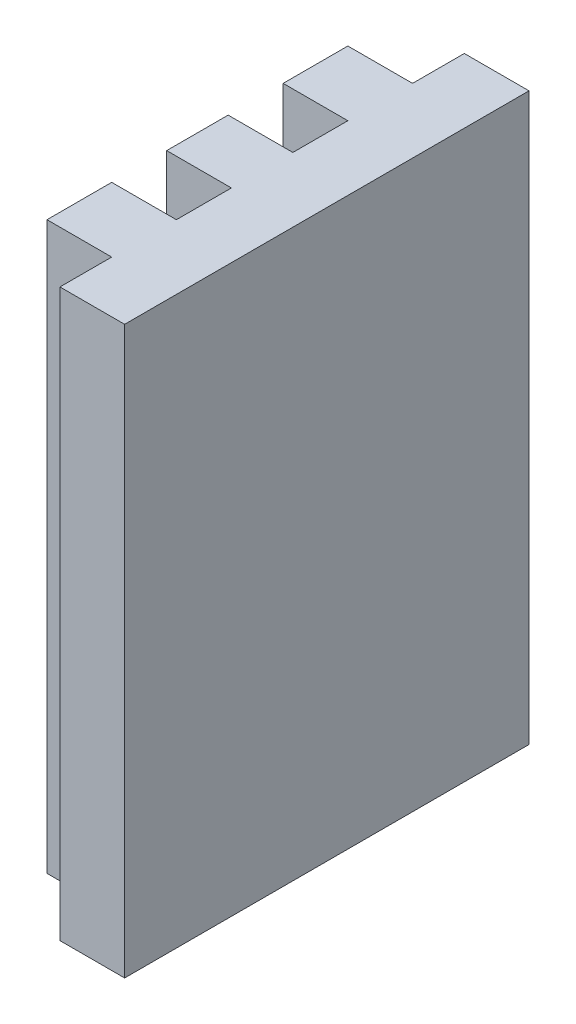
ISO-10303-21;
HEADER;
FILE_DESCRIPTION(('STEP AP214'),'2;1');
FILE_NAME('part.step','',(''),(''),'','','');
FILE_SCHEMA(('AUTOMOTIVE_DESIGN { 1 0 10303 214 1 1 1 1 }'));
ENDSEC;
DATA;
#1=APPLICATION_CONTEXT('core data for automotive mechanical design processes');
#2=APPLICATION_PROTOCOL_DEFINITION('international standard','automotive_design',2000,#1);
#3=PRODUCT_CONTEXT('',#1,'mechanical');
#4=PRODUCT('Part','Part','',(#3));
#5=PRODUCT_RELATED_PRODUCT_CATEGORY('part','',(#4));
#6=PRODUCT_DEFINITION_FORMATION('','',#4);
#7=PRODUCT_DEFINITION_CONTEXT('part definition',#1,'design');
#8=PRODUCT_DEFINITION('design','',#6,#7);
#9=PRODUCT_DEFINITION_SHAPE('','',#8);
#10=(LENGTH_UNIT() NAMED_UNIT(*) SI_UNIT(.MILLI.,.METRE.));
#11=(NAMED_UNIT(*) PLANE_ANGLE_UNIT() SI_UNIT($,.RADIAN.));
#12=(NAMED_UNIT(*) SI_UNIT($,.STERADIAN.) SOLID_ANGLE_UNIT());
#13=UNCERTAINTY_MEASURE_WITH_UNIT(LENGTH_MEASURE(1.E-05),#10,'distance_accuracy_value','');
#14=(GEOMETRIC_REPRESENTATION_CONTEXT(3) GLOBAL_UNCERTAINTY_ASSIGNED_CONTEXT((#13)) GLOBAL_UNIT_ASSIGNED_CONTEXT((#10,
#11,#12)) REPRESENTATION_CONTEXT('',''));
#15=CARTESIAN_POINT('',(0.,0.,0.));
#16=DIRECTION('',(0.,0.,1.));
#17=DIRECTION('',(1.,0.,0.));
#18=AXIS2_PLACEMENT_3D('',#15,#16,#17);
#19=CARTESIAN_POINT('',(7.,11.,-4.65));
#20=DIRECTION('',(1.,0.,0.));
#21=DIRECTION('',(0.,0.,-1.));
#22=AXIS2_PLACEMENT_3D('',#19,#20,#21);
#23=PLANE('',#22);
#24=DIRECTION('',(0.,0.,1.));
#25=VECTOR('',#24,1.);
#26=CARTESIAN_POINT('',(7.,-6.5,-4.65));
#27=LINE('',#26,#25);
#28=CARTESIAN_POINT('',(7.,-6.5,-4.65));
#29=VERTEX_POINT('',#28);
#30=CARTESIAN_POINT('',(7.,-6.5,-2.65));
#31=VERTEX_POINT('',#30);
#32=EDGE_CURVE('E21',#29,#31,#27,.T.);
#33=ORIENTED_EDGE('',*,*,#32,.T.);
#34=DIRECTION('',(0.,-1.,0.));
#35=VECTOR('',#34,1.);
#36=CARTESIAN_POINT('',(7.,11.,-2.65));
#37=LINE('',#36,#35);
#38=CARTESIAN_POINT('',(7.,11.,-2.65));
#39=VERTEX_POINT('',#38);
#40=EDGE_CURVE('E144',#39,#31,#37,.T.);
#41=ORIENTED_EDGE('',*,*,#40,.F.);
#42=DIRECTION('',(0.,0.,1.));
#43=VECTOR('',#42,1.);
#44=CARTESIAN_POINT('',(7.,11.,-4.65));
#45=LINE('',#44,#43);
#46=CARTESIAN_POINT('',(7.,11.,-4.65));
#47=VERTEX_POINT('',#46);
#48=EDGE_CURVE('E149',#47,#39,#45,.T.);
#49=ORIENTED_EDGE('',*,*,#48,.F.);
#50=DIRECTION('',(0.,-1.,0.));
#51=VECTOR('',#50,1.);
#52=CARTESIAN_POINT('',(7.,11.,-4.65));
#53=LINE('',#52,#51);
#54=EDGE_CURVE('E141',#47,#29,#53,.T.);
#55=ORIENTED_EDGE('',*,*,#54,.T.);
#56=EDGE_LOOP('',(#33,#41,#49,#55));
#57=FACE_BOUND('',#56,.T.);
#58=ADVANCED_FACE('F17',(#57),#23,.F.);
#59=CARTESIAN_POINT('',(7.,11.,-2.65));
#60=DIRECTION('',(0.,0.,-1.));
#61=DIRECTION('',(-1.,0.,0.));
#62=AXIS2_PLACEMENT_3D('',#59,#60,#61);
#63=PLANE('',#62);
#64=DIRECTION('',(1.,0.,0.));
#65=VECTOR('',#64,1.);
#66=CARTESIAN_POINT('',(7.,-6.5,-2.65));
#67=LINE('',#66,#65);
#68=CARTESIAN_POINT('',(9.,-6.5,-2.65));
#69=VERTEX_POINT('',#68);
#70=EDGE_CURVE('E133',#31,#69,#67,.T.);
#71=ORIENTED_EDGE('',*,*,#70,.T.);
#72=DIRECTION('',(0.,-1.,0.));
#73=VECTOR('',#72,1.);
#74=CARTESIAN_POINT('',(9.,11.,-2.65));
#75=LINE('',#74,#73);
#76=CARTESIAN_POINT('',(9.,11.,-2.65));
#77=VERTEX_POINT('',#76);
#78=EDGE_CURVE('E140',#77,#69,#75,.T.);
#79=ORIENTED_EDGE('',*,*,#78,.F.);
#80=DIRECTION('',(1.,0.,0.));
#81=VECTOR('',#80,1.);
#82=CARTESIAN_POINT('',(7.,11.,-2.65));
#83=LINE('',#82,#81);
#84=EDGE_CURVE('E127',#39,#77,#83,.T.);
#85=ORIENTED_EDGE('',*,*,#84,.F.);
#86=ORIENTED_EDGE('',*,*,#40,.T.);
#87=EDGE_LOOP('',(#71,#79,#85,#86));
#88=FACE_BOUND('',#87,.T.);
#89=ADVANCED_FACE('F145',(#88),#63,.F.);
#90=CARTESIAN_POINT('',(9.,11.,-2.65));
#91=DIRECTION('',(1.,0.,0.));
#92=DIRECTION('',(0.,0.,-1.));
#93=AXIS2_PLACEMENT_3D('',#90,#91,#92);
#94=PLANE('',#93);
#95=DIRECTION('',(0.,0.,1.));
#96=VECTOR('',#95,1.);
#97=CARTESIAN_POINT('',(9.,-6.5,-2.65));
#98=LINE('',#97,#96);
#99=CARTESIAN_POINT('',(9.,-6.5,-0.95));
#100=VERTEX_POINT('',#99);
#101=EDGE_CURVE('E137',#69,#100,#98,.T.);
#102=ORIENTED_EDGE('',*,*,#101,.T.);
#103=DIRECTION('',(0.,-1.,0.));
#104=VECTOR('',#103,1.);
#105=CARTESIAN_POINT('',(9.,11.,-0.95));
#106=LINE('',#105,#104);
#107=CARTESIAN_POINT('',(9.,11.,-0.95));
#108=VERTEX_POINT('',#107);
#109=EDGE_CURVE('E198',#108,#100,#106,.T.);
#110=ORIENTED_EDGE('',*,*,#109,.F.);
#111=DIRECTION('',(0.,0.,1.));
#112=VECTOR('',#111,1.);
#113=CARTESIAN_POINT('',(9.,11.,-2.65));
#114=LINE('',#113,#112);
#115=EDGE_CURVE('E203',#77,#108,#114,.T.);
#116=ORIENTED_EDGE('',*,*,#115,.F.);
#117=ORIENTED_EDGE('',*,*,#78,.T.);
#118=EDGE_LOOP('',(#102,#110,#116,#117));
#119=FACE_BOUND('',#118,.T.);
#120=ADVANCED_FACE('F171',(#119),#94,.F.);
#121=CARTESIAN_POINT('',(9.,11.,-0.95));
#122=DIRECTION('',(0.,0.,1.));
#123=DIRECTION('',(1.,0.,0.));
#124=AXIS2_PLACEMENT_3D('',#121,#122,#123);
#125=PLANE('',#124);
#126=DIRECTION('',(-1.,0.,0.));
#127=VECTOR('',#126,1.);
#128=CARTESIAN_POINT('',(9.,-6.5,-0.95));
#129=LINE('',#128,#127);
#130=CARTESIAN_POINT('',(7.,-6.5,-0.95));
#131=VERTEX_POINT('',#130);
#132=EDGE_CURVE('E207',#100,#131,#129,.T.);
#133=ORIENTED_EDGE('',*,*,#132,.T.);
#134=DIRECTION('',(0.,-1.,0.));
#135=VECTOR('',#134,1.);
#136=CARTESIAN_POINT('',(7.,11.,-0.95));
#137=LINE('',#136,#135);
#138=CARTESIAN_POINT('',(7.,11.,-0.95));
#139=VERTEX_POINT('',#138);
#140=EDGE_CURVE('E221',#139,#131,#137,.T.);
#141=ORIENTED_EDGE('',*,*,#140,.F.);
#142=DIRECTION('',(-1.,0.,0.));
#143=VECTOR('',#142,1.);
#144=CARTESIAN_POINT('',(9.,11.,-0.95));
#145=LINE('',#144,#143);
#146=EDGE_CURVE('E226',#108,#139,#145,.T.);
#147=ORIENTED_EDGE('',*,*,#146,.F.);
#148=ORIENTED_EDGE('',*,*,#109,.T.);
#149=EDGE_LOOP('',(#133,#141,#147,#148));
#150=FACE_BOUND('',#149,.T.);
#151=ADVANCED_FACE('F189',(#150),#125,.F.);
#152=CARTESIAN_POINT('',(7.,11.,-0.95));
#153=DIRECTION('',(1.,0.,0.));
#154=DIRECTION('',(0.,0.,-1.));
#155=AXIS2_PLACEMENT_3D('',#152,#153,#154);
#156=PLANE('',#155);
#157=DIRECTION('',(0.,0.,1.));
#158=VECTOR('',#157,1.);
#159=CARTESIAN_POINT('',(7.,-6.5,-0.95));
#160=LINE('',#159,#158);
#161=CARTESIAN_POINT('',(7.,-6.5,0.95));
#162=VERTEX_POINT('',#161);
#163=EDGE_CURVE('E230',#131,#162,#160,.T.);
#164=ORIENTED_EDGE('',*,*,#163,.T.);
#165=DIRECTION('',(0.,-1.,0.));
#166=VECTOR('',#165,1.);
#167=CARTESIAN_POINT('',(7.,11.,0.95));
#168=LINE('',#167,#166);
#169=CARTESIAN_POINT('',(7.,11.,0.95));
#170=VERTEX_POINT('',#169);
#171=EDGE_CURVE('E244',#170,#162,#168,.T.);
#172=ORIENTED_EDGE('',*,*,#171,.F.);
#173=DIRECTION('',(0.,0.,1.));
#174=VECTOR('',#173,1.);
#175=CARTESIAN_POINT('',(7.,11.,-0.95));
#176=LINE('',#175,#174);
#177=EDGE_CURVE('E249',#139,#170,#176,.T.);
#178=ORIENTED_EDGE('',*,*,#177,.F.);
#179=ORIENTED_EDGE('',*,*,#140,.T.);
#180=EDGE_LOOP('',(#164,#172,#178,#179));
#181=FACE_BOUND('',#180,.T.);
#182=ADVANCED_FACE('F212',(#181),#156,.F.);
#183=CARTESIAN_POINT('',(7.,11.,0.95));
#184=DIRECTION('',(0.,0.,-1.));
#185=DIRECTION('',(-1.,0.,0.));
#186=AXIS2_PLACEMENT_3D('',#183,#184,#185);
#187=PLANE('',#186);
#188=DIRECTION('',(1.,0.,0.));
#189=VECTOR('',#188,1.);
#190=CARTESIAN_POINT('',(7.,-6.5,0.95));
#191=LINE('',#190,#189);
#192=CARTESIAN_POINT('',(9.,-6.5,0.95));
#193=VERTEX_POINT('',#192);
#194=EDGE_CURVE('E253',#162,#193,#191,.T.);
#195=ORIENTED_EDGE('',*,*,#194,.T.);
#196=DIRECTION('',(0.,-1.,0.));
#197=VECTOR('',#196,1.);
#198=CARTESIAN_POINT('',(9.,11.,0.95));
#199=LINE('',#198,#197);
#200=CARTESIAN_POINT('',(9.,11.,0.95));
#201=VERTEX_POINT('',#200);
#202=EDGE_CURVE('E267',#201,#193,#199,.T.);
#203=ORIENTED_EDGE('',*,*,#202,.F.);
#204=DIRECTION('',(1.,0.,0.));
#205=VECTOR('',#204,1.);
#206=CARTESIAN_POINT('',(7.,11.,0.95));
#207=LINE('',#206,#205);
#208=EDGE_CURVE('E272',#170,#201,#207,.T.);
#209=ORIENTED_EDGE('',*,*,#208,.F.);
#210=ORIENTED_EDGE('',*,*,#171,.T.);
#211=EDGE_LOOP('',(#195,#203,#209,#210));
#212=FACE_BOUND('',#211,.T.);
#213=ADVANCED_FACE('F235',(#212),#187,.F.);
#214=CARTESIAN_POINT('',(9.,11.,0.95));
#215=DIRECTION('',(1.,0.,0.));
#216=DIRECTION('',(0.,0.,-1.));
#217=AXIS2_PLACEMENT_3D('',#214,#215,#216);
#218=PLANE('',#217);
#219=DIRECTION('',(0.,0.,1.));
#220=VECTOR('',#219,1.);
#221=CARTESIAN_POINT('',(9.,-6.5,0.95));
#222=LINE('',#221,#220);
#223=CARTESIAN_POINT('',(9.,-6.5,2.65));
#224=VERTEX_POINT('',#223);
#225=EDGE_CURVE('E276',#193,#224,#222,.T.);
#226=ORIENTED_EDGE('',*,*,#225,.T.);
#227=DIRECTION('',(0.,-1.,0.));
#228=VECTOR('',#227,1.);
#229=CARTESIAN_POINT('',(9.,11.,2.65));
#230=LINE('',#229,#228);
#231=CARTESIAN_POINT('',(9.,11.,2.65));
#232=VERTEX_POINT('',#231);
#233=EDGE_CURVE('E290',#232,#224,#230,.T.);
#234=ORIENTED_EDGE('',*,*,#233,.F.);
#235=DIRECTION('',(0.,0.,1.));
#236=VECTOR('',#235,1.);
#237=CARTESIAN_POINT('',(9.,11.,0.95));
#238=LINE('',#237,#236);
#239=EDGE_CURVE('E295',#201,#232,#238,.T.);
#240=ORIENTED_EDGE('',*,*,#239,.F.);
#241=ORIENTED_EDGE('',*,*,#202,.T.);
#242=EDGE_LOOP('',(#226,#234,#240,#241));
#243=FACE_BOUND('',#242,.T.);
#244=ADVANCED_FACE('F258',(#243),#218,.F.);
#245=CARTESIAN_POINT('',(9.,11.,2.65));
#246=DIRECTION('',(0.,0.,1.));
#247=DIRECTION('',(1.,0.,0.));
#248=AXIS2_PLACEMENT_3D('',#245,#246,#247);
#249=PLANE('',#248);
#250=DIRECTION('',(-1.,0.,0.));
#251=VECTOR('',#250,1.);
#252=CARTESIAN_POINT('',(9.,-6.5,2.65));
#253=LINE('',#252,#251);
#254=CARTESIAN_POINT('',(7.,-6.5,2.65));
#255=VERTEX_POINT('',#254);
#256=EDGE_CURVE('E299',#224,#255,#253,.T.);
#257=ORIENTED_EDGE('',*,*,#256,.T.);
#258=DIRECTION('',(0.,-1.,0.));
#259=VECTOR('',#258,1.);
#260=CARTESIAN_POINT('',(7.,11.,2.65));
#261=LINE('',#260,#259);
#262=CARTESIAN_POINT('',(7.,11.,2.65));
#263=VERTEX_POINT('',#262);
#264=EDGE_CURVE('E313',#263,#255,#261,.T.);
#265=ORIENTED_EDGE('',*,*,#264,.F.);
#266=DIRECTION('',(-1.,0.,0.));
#267=VECTOR('',#266,1.);
#268=CARTESIAN_POINT('',(9.,11.,2.65));
#269=LINE('',#268,#267);
#270=EDGE_CURVE('E318',#232,#263,#269,.T.);
#271=ORIENTED_EDGE('',*,*,#270,.F.);
#272=ORIENTED_EDGE('',*,*,#233,.T.);
#273=EDGE_LOOP('',(#257,#265,#271,#272));
#274=FACE_BOUND('',#273,.T.);
#275=ADVANCED_FACE('F281',(#274),#249,.F.);
#276=CARTESIAN_POINT('',(7.,11.,2.65));
#277=DIRECTION('',(1.,0.,0.));
#278=DIRECTION('',(0.,0.,-1.));
#279=AXIS2_PLACEMENT_3D('',#276,#277,#278);
#280=PLANE('',#279);
#281=DIRECTION('',(0.,0.,1.));
#282=VECTOR('',#281,1.);
#283=CARTESIAN_POINT('',(7.,-6.5,2.65));
#284=LINE('',#283,#282);
#285=CARTESIAN_POINT('',(7.,-6.5,4.65));
#286=VERTEX_POINT('',#285);
#287=EDGE_CURVE('E322',#255,#286,#284,.T.);
#288=ORIENTED_EDGE('',*,*,#287,.T.);
#289=DIRECTION('',(0.,-1.,0.));
#290=VECTOR('',#289,1.);
#291=CARTESIAN_POINT('',(7.,11.,4.65));
#292=LINE('',#291,#290);
#293=CARTESIAN_POINT('',(7.,11.,4.65));
#294=VERTEX_POINT('',#293);
#295=EDGE_CURVE('E336',#294,#286,#292,.T.);
#296=ORIENTED_EDGE('',*,*,#295,.F.);
#297=DIRECTION('',(0.,0.,1.));
#298=VECTOR('',#297,1.);
#299=CARTESIAN_POINT('',(7.,11.,2.65));
#300=LINE('',#299,#298);
#301=EDGE_CURVE('E341',#263,#294,#300,.T.);
#302=ORIENTED_EDGE('',*,*,#301,.F.);
#303=ORIENTED_EDGE('',*,*,#264,.T.);
#304=EDGE_LOOP('',(#288,#296,#302,#303));
#305=FACE_BOUND('',#304,.T.);
#306=ADVANCED_FACE('F304',(#305),#280,.F.);
#307=CARTESIAN_POINT('',(7.,11.,4.65));
#308=DIRECTION('',(0.,0.,-1.));
#309=DIRECTION('',(-1.,0.,0.));
#310=AXIS2_PLACEMENT_3D('',#307,#308,#309);
#311=PLANE('',#310);
#312=DIRECTION('',(1.,0.,0.));
#313=VECTOR('',#312,1.);
#314=CARTESIAN_POINT('',(7.,-6.5,4.65));
#315=LINE('',#314,#313);
#316=CARTESIAN_POINT('',(9.,-6.5,4.65));
#317=VERTEX_POINT('',#316);
#318=EDGE_CURVE('E345',#286,#317,#315,.T.);
#319=ORIENTED_EDGE('',*,*,#318,.T.);
#320=DIRECTION('',(0.,-1.,0.));
#321=VECTOR('',#320,1.);
#322=CARTESIAN_POINT('',(9.,11.,4.65));
#323=LINE('',#322,#321);
#324=CARTESIAN_POINT('',(9.,11.,4.65));
#325=VERTEX_POINT('',#324);
#326=EDGE_CURVE('E359',#325,#317,#323,.T.);
#327=ORIENTED_EDGE('',*,*,#326,.F.);
#328=DIRECTION('',(1.,0.,0.));
#329=VECTOR('',#328,1.);
#330=CARTESIAN_POINT('',(7.,11.,4.65));
#331=LINE('',#330,#329);
#332=EDGE_CURVE('E364',#294,#325,#331,.T.);
#333=ORIENTED_EDGE('',*,*,#332,.F.);
#334=ORIENTED_EDGE('',*,*,#295,.T.);
#335=EDGE_LOOP('',(#319,#327,#333,#334));
#336=FACE_BOUND('',#335,.T.);
#337=ADVANCED_FACE('F327',(#336),#311,.F.);
#338=CARTESIAN_POINT('',(9.,11.,4.65));
#339=DIRECTION('',(1.,0.,0.));
#340=DIRECTION('',(0.,0.,-1.));
#341=AXIS2_PLACEMENT_3D('',#338,#339,#340);
#342=PLANE('',#341);
#343=DIRECTION('',(0.,0.,1.));
#344=VECTOR('',#343,1.);
#345=CARTESIAN_POINT('',(9.,-6.5,4.65));
#346=LINE('',#345,#344);
#347=CARTESIAN_POINT('',(9.,-6.5,6.25));
#348=VERTEX_POINT('',#347);
#349=EDGE_CURVE('E368',#317,#348,#346,.T.);
#350=ORIENTED_EDGE('',*,*,#349,.T.);
#351=DIRECTION('',(0.,-1.,0.));
#352=VECTOR('',#351,1.);
#353=CARTESIAN_POINT('',(9.,11.,6.25));
#354=LINE('',#353,#352);
#355=CARTESIAN_POINT('',(9.,11.,6.25));
#356=VERTEX_POINT('',#355);
#357=EDGE_CURVE('E382',#356,#348,#354,.T.);
#358=ORIENTED_EDGE('',*,*,#357,.F.);
#359=DIRECTION('',(0.,0.,1.));
#360=VECTOR('',#359,1.);
#361=CARTESIAN_POINT('',(9.,11.,4.65));
#362=LINE('',#361,#360);
#363=EDGE_CURVE('E387',#325,#356,#362,.T.);
#364=ORIENTED_EDGE('',*,*,#363,.F.);
#365=ORIENTED_EDGE('',*,*,#326,.T.);
#366=EDGE_LOOP('',(#350,#358,#364,#365));
#367=FACE_BOUND('',#366,.T.);
#368=ADVANCED_FACE('F350',(#367),#342,.F.);
#369=CARTESIAN_POINT('',(9.,11.,6.25));
#370=DIRECTION('',(0.,0.,-1.));
#371=DIRECTION('',(-1.,0.,0.));
#372=AXIS2_PLACEMENT_3D('',#369,#370,#371);
#373=PLANE('',#372);
#374=DIRECTION('',(1.,0.,0.));
#375=VECTOR('',#374,1.);
#376=CARTESIAN_POINT('',(9.,-6.5,6.25));
#377=LINE('',#376,#375);
#378=CARTESIAN_POINT('',(11.,-6.5,6.25));
#379=VERTEX_POINT('',#378);
#380=EDGE_CURVE('E391',#348,#379,#377,.T.);
#381=ORIENTED_EDGE('',*,*,#380,.T.);
#382=DIRECTION('',(0.,-1.,0.));
#383=VECTOR('',#382,1.);
#384=CARTESIAN_POINT('',(11.,11.,6.25));
#385=LINE('',#384,#383);
#386=CARTESIAN_POINT('',(11.,11.,6.25));
#387=VERTEX_POINT('',#386);
#388=EDGE_CURVE('E405',#387,#379,#385,.T.);
#389=ORIENTED_EDGE('',*,*,#388,.F.);
#390=DIRECTION('',(1.,0.,0.));
#391=VECTOR('',#390,1.);
#392=CARTESIAN_POINT('',(9.,11.,6.25));
#393=LINE('',#392,#391);
#394=EDGE_CURVE('E410',#356,#387,#393,.T.);
#395=ORIENTED_EDGE('',*,*,#394,.F.);
#396=ORIENTED_EDGE('',*,*,#357,.T.);
#397=EDGE_LOOP('',(#381,#389,#395,#396));
#398=FACE_BOUND('',#397,.T.);
#399=ADVANCED_FACE('F373',(#398),#373,.F.);
#400=CARTESIAN_POINT('',(11.,11.,6.25));
#401=DIRECTION('',(-1.,0.,0.));
#402=DIRECTION('',(0.,0.,1.));
#403=AXIS2_PLACEMENT_3D('',#400,#401,#402);
#404=PLANE('',#403);
#405=DIRECTION('',(0.,0.,-1.));
#406=VECTOR('',#405,1.);
#407=CARTESIAN_POINT('',(11.,-6.5,6.25));
#408=LINE('',#407,#406);
#409=CARTESIAN_POINT('',(11.,-6.5,-6.25));
#410=VERTEX_POINT('',#409);
#411=EDGE_CURVE('E414',#379,#410,#408,.T.);
#412=ORIENTED_EDGE('',*,*,#411,.T.);
#413=DIRECTION('',(0.,-1.,0.));
#414=VECTOR('',#413,1.);
#415=CARTESIAN_POINT('',(11.,11.,-6.25));
#416=LINE('',#415,#414);
#417=CARTESIAN_POINT('',(11.,11.,-6.25));
#418=VERTEX_POINT('',#417);
#419=EDGE_CURVE('E428',#418,#410,#416,.T.);
#420=ORIENTED_EDGE('',*,*,#419,.F.);
#421=DIRECTION('',(0.,0.,-1.));
#422=VECTOR('',#421,1.);
#423=CARTESIAN_POINT('',(11.,11.,6.25));
#424=LINE('',#423,#422);
#425=EDGE_CURVE('E433',#387,#418,#424,.T.);
#426=ORIENTED_EDGE('',*,*,#425,.F.);
#427=ORIENTED_EDGE('',*,*,#388,.T.);
#428=EDGE_LOOP('',(#412,#420,#426,#427));
#429=FACE_BOUND('',#428,.T.);
#430=ADVANCED_FACE('F396',(#429),#404,.F.);
#431=CARTESIAN_POINT('',(11.,11.,-6.25));
#432=DIRECTION('',(0.,0.,1.));
#433=DIRECTION('',(1.,0.,0.));
#434=AXIS2_PLACEMENT_3D('',#431,#432,#433);
#435=PLANE('',#434);
#436=DIRECTION('',(-1.,0.,0.));
#437=VECTOR('',#436,1.);
#438=CARTESIAN_POINT('',(11.,-6.5,-6.25));
#439=LINE('',#438,#437);
#440=CARTESIAN_POINT('',(9.,-6.5,-6.25));
#441=VERTEX_POINT('',#440);
#442=EDGE_CURVE('E437',#410,#441,#439,.T.);
#443=ORIENTED_EDGE('',*,*,#442,.T.);
#444=DIRECTION('',(0.,-1.,0.));
#445=VECTOR('',#444,1.);
#446=CARTESIAN_POINT('',(9.,11.,-6.25));
#447=LINE('',#446,#445);
#448=CARTESIAN_POINT('',(9.,11.,-6.25));
#449=VERTEX_POINT('',#448);
#450=EDGE_CURVE('E451',#449,#441,#447,.T.);
#451=ORIENTED_EDGE('',*,*,#450,.F.);
#452=DIRECTION('',(-1.,0.,0.));
#453=VECTOR('',#452,1.);
#454=CARTESIAN_POINT('',(11.,11.,-6.25));
#455=LINE('',#454,#453);
#456=EDGE_CURVE('E456',#418,#449,#455,.T.);
#457=ORIENTED_EDGE('',*,*,#456,.F.);
#458=ORIENTED_EDGE('',*,*,#419,.T.);
#459=EDGE_LOOP('',(#443,#451,#457,#458));
#460=FACE_BOUND('',#459,.T.);
#461=ADVANCED_FACE('F419',(#460),#435,.F.);
#462=CARTESIAN_POINT('',(9.,11.,-6.25));
#463=DIRECTION('',(1.,0.,0.));
#464=DIRECTION('',(0.,0.,-1.));
#465=AXIS2_PLACEMENT_3D('',#462,#463,#464);
#466=PLANE('',#465);
#467=DIRECTION('',(0.,0.,1.));
#468=VECTOR('',#467,1.);
#469=CARTESIAN_POINT('',(9.,-6.5,-6.25));
#470=LINE('',#469,#468);
#471=CARTESIAN_POINT('',(9.,-6.5,-4.65));
#472=VERTEX_POINT('',#471);
#473=EDGE_CURVE('E460',#441,#472,#470,.T.);
#474=ORIENTED_EDGE('',*,*,#473,.T.);
#475=DIRECTION('',(0.,-1.,0.));
#476=VECTOR('',#475,1.);
#477=CARTESIAN_POINT('',(9.,11.,-4.65));
#478=LINE('',#477,#476);
#479=CARTESIAN_POINT('',(9.,11.,-4.65));
#480=VERTEX_POINT('',#479);
#481=EDGE_CURVE('E474',#480,#472,#478,.T.);
#482=ORIENTED_EDGE('',*,*,#481,.F.);
#483=DIRECTION('',(0.,0.,1.));
#484=VECTOR('',#483,1.);
#485=CARTESIAN_POINT('',(9.,11.,-6.25));
#486=LINE('',#485,#484);
#487=EDGE_CURVE('E36',#449,#480,#486,.T.);
#488=ORIENTED_EDGE('',*,*,#487,.F.);
#489=ORIENTED_EDGE('',*,*,#450,.T.);
#490=EDGE_LOOP('',(#474,#482,#488,#489));
#491=FACE_BOUND('',#490,.T.);
#492=ADVANCED_FACE('F442',(#491),#466,.F.);
#493=CARTESIAN_POINT('',(9.,11.,-4.65));
#494=DIRECTION('',(0.,0.,1.));
#495=DIRECTION('',(1.,0.,0.));
#496=AXIS2_PLACEMENT_3D('',#493,#494,#495);
#497=PLANE('',#496);
#498=DIRECTION('',(-1.,0.,0.));
#499=VECTOR('',#498,1.);
#500=CARTESIAN_POINT('',(9.,-6.5,-4.65));
#501=LINE('',#500,#499);
#502=EDGE_CURVE('E28',#472,#29,#501,.T.);
#503=ORIENTED_EDGE('',*,*,#502,.T.);
#504=ORIENTED_EDGE('',*,*,#54,.F.);
#505=DIRECTION('',(-1.,0.,0.));
#506=VECTOR('',#505,1.);
#507=CARTESIAN_POINT('',(9.,11.,-4.65));
#508=LINE('',#507,#506);
#509=EDGE_CURVE('E11',#480,#47,#508,.T.);
#510=ORIENTED_EDGE('',*,*,#509,.F.);
#511=ORIENTED_EDGE('',*,*,#481,.T.);
#512=EDGE_LOOP('',(#503,#504,#510,#511));
#513=FACE_BOUND('',#512,.T.);
#514=ADVANCED_FACE('F465',(#513),#497,.F.);
#515=CARTESIAN_POINT('',(0.,11.,0.));
#516=DIRECTION('',(0.,1.,0.));
#517=DIRECTION('',(0.,0.,1.));
#518=AXIS2_PLACEMENT_3D('',#515,#516,#517);
#519=PLANE('',#518);
#520=ORIENTED_EDGE('',*,*,#48,.T.);
#521=ORIENTED_EDGE('',*,*,#84,.T.);
#522=ORIENTED_EDGE('',*,*,#115,.T.);
#523=ORIENTED_EDGE('',*,*,#146,.T.);
#524=ORIENTED_EDGE('',*,*,#177,.T.);
#525=ORIENTED_EDGE('',*,*,#208,.T.);
#526=ORIENTED_EDGE('',*,*,#239,.T.);
#527=ORIENTED_EDGE('',*,*,#270,.T.);
#528=ORIENTED_EDGE('',*,*,#301,.T.);
#529=ORIENTED_EDGE('',*,*,#332,.T.);
#530=ORIENTED_EDGE('',*,*,#363,.T.);
#531=ORIENTED_EDGE('',*,*,#394,.T.);
#532=ORIENTED_EDGE('',*,*,#425,.T.);
#533=ORIENTED_EDGE('',*,*,#456,.T.);
#534=ORIENTED_EDGE('',*,*,#487,.T.);
#535=ORIENTED_EDGE('',*,*,#509,.T.);
#536=EDGE_LOOP('',(#520,#521,#522,#523,#524,#525,#526,#527,#528,#529,#530,#531,#532,#533,#534,#535));
#537=FACE_BOUND('',#536,.T.);
#538=ADVANCED_FACE('F486',(#537),#519,.T.);
#539=CARTESIAN_POINT('',(0.,-6.5,0.));
#540=DIRECTION('',(0.,1.,0.));
#541=DIRECTION('',(0.,0.,1.));
#542=AXIS2_PLACEMENT_3D('',#539,#540,#541);
#543=PLANE('',#542);
#544=ORIENTED_EDGE('',*,*,#32,.F.);
#545=ORIENTED_EDGE('',*,*,#502,.F.);
#546=ORIENTED_EDGE('',*,*,#473,.F.);
#547=ORIENTED_EDGE('',*,*,#442,.F.);
#548=ORIENTED_EDGE('',*,*,#411,.F.);
#549=ORIENTED_EDGE('',*,*,#380,.F.);
#550=ORIENTED_EDGE('',*,*,#349,.F.);
#551=ORIENTED_EDGE('',*,*,#318,.F.);
#552=ORIENTED_EDGE('',*,*,#287,.F.);
#553=ORIENTED_EDGE('',*,*,#256,.F.);
#554=ORIENTED_EDGE('',*,*,#225,.F.);
#555=ORIENTED_EDGE('',*,*,#194,.F.);
#556=ORIENTED_EDGE('',*,*,#163,.F.);
#557=ORIENTED_EDGE('',*,*,#132,.F.);
#558=ORIENTED_EDGE('',*,*,#101,.F.);
#559=ORIENTED_EDGE('',*,*,#70,.F.);
#560=EDGE_LOOP('',(#544,#545,#546,#547,#548,#549,#550,#551,#552,#553,#554,#555,#556,#557,#558,#559));
#561=FACE_BOUND('',#560,.T.);
#562=ADVANCED_FACE('F19',(#561),#543,.F.);
#563=CLOSED_SHELL('',(#58,#89,#120,#151,#182,#213,#244,#275,#306,#337,#368,#399,#430,#461,#492,
#514,#538,#562));
#564=MANIFOLD_SOLID_BREP('B1',#563);
#565=ADVANCED_BREP_SHAPE_REPRESENTATION('',(#18,#564),#14);
#566=SHAPE_DEFINITION_REPRESENTATION(#9,#565);
ENDSEC;
END-ISO-10303-21;
